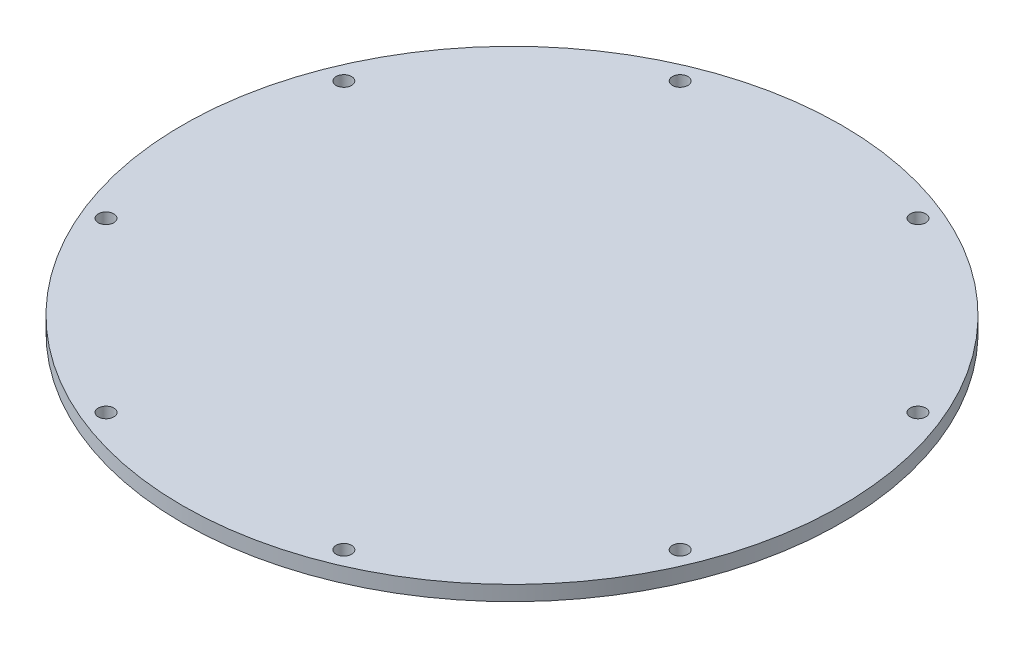
ISO-10303-21;
HEADER;
FILE_DESCRIPTION(('STEP AP214'),'2;1');
FILE_NAME('part.step','',(''),(''),'','','');
FILE_SCHEMA(('AUTOMOTIVE_DESIGN { 1 0 10303 214 1 1 1 1 }'));
ENDSEC;
DATA;
#1=APPLICATION_CONTEXT('core data for automotive mechanical design processes');
#2=APPLICATION_PROTOCOL_DEFINITION('international standard','automotive_design',2000,#1);
#3=PRODUCT_CONTEXT('',#1,'mechanical');
#4=PRODUCT('Part','Part','',(#3));
#5=PRODUCT_RELATED_PRODUCT_CATEGORY('part','',(#4));
#6=PRODUCT_DEFINITION_FORMATION('','',#4);
#7=PRODUCT_DEFINITION_CONTEXT('part definition',#1,'design');
#8=PRODUCT_DEFINITION('design','',#6,#7);
#9=PRODUCT_DEFINITION_SHAPE('','',#8);
#10=(LENGTH_UNIT() NAMED_UNIT(*) SI_UNIT(.MILLI.,.METRE.));
#11=(NAMED_UNIT(*) PLANE_ANGLE_UNIT() SI_UNIT($,.RADIAN.));
#12=(NAMED_UNIT(*) SI_UNIT($,.STERADIAN.) SOLID_ANGLE_UNIT());
#13=UNCERTAINTY_MEASURE_WITH_UNIT(LENGTH_MEASURE(1.E-05),#10,'distance_accuracy_value','');
#14=(GEOMETRIC_REPRESENTATION_CONTEXT(3) GLOBAL_UNCERTAINTY_ASSIGNED_CONTEXT((#13)) GLOBAL_UNIT_ASSIGNED_CONTEXT((#10,
#11,#12)) REPRESENTATION_CONTEXT('',''));
#15=CARTESIAN_POINT('',(0.,0.,0.));
#16=DIRECTION('',(0.,0.,1.));
#17=DIRECTION('',(1.,0.,0.));
#18=AXIS2_PLACEMENT_3D('',#15,#16,#17);
#19=CARTESIAN_POINT('',(0.,3.175,0.));
#20=DIRECTION('',(0.,-1.,0.));
#21=DIRECTION('',(0.,0.,-1.));
#22=AXIS2_PLACEMENT_3D('',#19,#20,#21);
#23=CYLINDRICAL_SURFACE('',#22,70.);
#24=CARTESIAN_POINT('',(0.,3.175,0.));
#25=DIRECTION('',(0.,1.,0.));
#26=DIRECTION('',(0.,0.,1.));
#27=AXIS2_PLACEMENT_3D('',#24,#25,#26);
#28=CIRCLE('',#27,70.);
#29=CARTESIAN_POINT('',(0.,3.175,70.));
#30=VERTEX_POINT('',#29);
#31=EDGE_CURVE('E10',#30,#30,#28,.T.);
#32=ORIENTED_EDGE('',*,*,#31,.F.);
#33=EDGE_LOOP('',(#32));
#34=FACE_BOUND('',#33,.T.);
#35=CARTESIAN_POINT('',(0.,0.,0.));
#36=DIRECTION('',(0.,1.,0.));
#37=DIRECTION('',(0.,0.,1.));
#38=AXIS2_PLACEMENT_3D('',#35,#36,#37);
#39=CIRCLE('',#38,70.);
#40=CARTESIAN_POINT('',(0.,0.,70.));
#41=VERTEX_POINT('',#40);
#42=EDGE_CURVE('E34',#41,#41,#39,.T.);
#43=ORIENTED_EDGE('',*,*,#42,.T.);
#44=EDGE_LOOP('',(#43));
#45=FACE_BOUND('',#44,.T.);
#46=ADVANCED_FACE('F31',(#34,#45),#23,.T.);
#47=CARTESIAN_POINT('',(0.,3.175,0.));
#48=DIRECTION('',(0.,1.,0.));
#49=DIRECTION('',(0.,0.,1.));
#50=AXIS2_PLACEMENT_3D('',#47,#48,#49);
#51=PLANE('',#50);
#52=CARTESIAN_POINT('',(60.9760491457449,3.175,-25.257106536096));
#53=DIRECTION('',(0.,1.,0.));
#54=DIRECTION('',(0.,0.,1.));
#55=AXIS2_PLACEMENT_3D('',#52,#53,#54);
#56=CIRCLE('',#55,1.65);
#57=CARTESIAN_POINT('',(60.9760491457449,3.175,-23.607106536096));
#58=VERTEX_POINT('',#57);
#59=EDGE_CURVE('E46',#58,#58,#56,.T.);
#60=ORIENTED_EDGE('',*,*,#59,.F.);
#61=EDGE_LOOP('',(#60));
#62=FACE_BOUND('',#61,.T.);
#63=CARTESIAN_POINT('',(60.9760491457449,3.175,25.257106536096));
#64=DIRECTION('',(0.,1.,0.));
#65=DIRECTION('',(0.,0.,-1.));
#66=AXIS2_PLACEMENT_3D('',#63,#64,#65);
#67=CIRCLE('',#66,1.65);
#68=CARTESIAN_POINT('',(60.9760491457449,3.175,23.607106536096));
#69=VERTEX_POINT('',#68);
#70=EDGE_CURVE('E65',#69,#69,#67,.T.);
#71=ORIENTED_EDGE('',*,*,#70,.F.);
#72=EDGE_LOOP('',(#71));
#73=FACE_BOUND('',#72,.T.);
#74=CARTESIAN_POINT('',(25.2571065360959,3.175,60.976049145745));
#75=DIRECTION('',(0.,1.,0.));
#76=DIRECTION('',(0.,0.,-1.));
#77=AXIS2_PLACEMENT_3D('',#74,#75,#76);
#78=CIRCLE('',#77,1.65);
#79=CARTESIAN_POINT('',(25.2571065360959,3.175,59.326049145745));
#80=VERTEX_POINT('',#79);
#81=EDGE_CURVE('E59',#80,#80,#78,.T.);
#82=ORIENTED_EDGE('',*,*,#81,.F.);
#83=EDGE_LOOP('',(#82));
#84=FACE_BOUND('',#83,.T.);
#85=CARTESIAN_POINT('',(-25.2571065360959,3.175,60.976049145745));
#86=DIRECTION('',(0.,1.,0.));
#87=DIRECTION('',(0.,0.,1.));
#88=AXIS2_PLACEMENT_3D('',#85,#86,#87);
#89=CIRCLE('',#88,1.65);
#90=CARTESIAN_POINT('',(-25.2571065360959,3.175,62.626049145745));
#91=VERTEX_POINT('',#90);
#92=EDGE_CURVE('E52',#91,#91,#89,.T.);
#93=ORIENTED_EDGE('',*,*,#92,.F.);
#94=EDGE_LOOP('',(#93));
#95=FACE_BOUND('',#94,.T.);
#96=CARTESIAN_POINT('',(-60.9760491457449,3.175,25.257106536096));
#97=DIRECTION('',(0.,1.,0.));
#98=DIRECTION('',(0.,0.,1.));
#99=AXIS2_PLACEMENT_3D('',#96,#97,#98);
#100=CIRCLE('',#99,1.65);
#101=CARTESIAN_POINT('',(-60.9760491457449,3.175,26.907106536096));
#102=VERTEX_POINT('',#101);
#103=EDGE_CURVE('E53',#102,#102,#100,.T.);
#104=ORIENTED_EDGE('',*,*,#103,.F.);
#105=EDGE_LOOP('',(#104));
#106=FACE_BOUND('',#105,.T.);
#107=CARTESIAN_POINT('',(-60.9760491457449,3.175,-25.257106536096));
#108=DIRECTION('',(0.,1.,0.));
#109=DIRECTION('',(0.,0.,-1.));
#110=AXIS2_PLACEMENT_3D('',#107,#108,#109);
#111=CIRCLE('',#110,1.65);
#112=CARTESIAN_POINT('',(-60.9760491457449,3.175,-26.907106536096));
#113=VERTEX_POINT('',#112);
#114=EDGE_CURVE('E82',#113,#113,#111,.T.);
#115=ORIENTED_EDGE('',*,*,#114,.F.);
#116=EDGE_LOOP('',(#115));
#117=FACE_BOUND('',#116,.T.);
#118=CARTESIAN_POINT('',(-25.2571065360959,3.175,-60.976049145745));
#119=DIRECTION('',(0.,1.,0.));
#120=DIRECTION('',(0.,0.,-1.));
#121=AXIS2_PLACEMENT_3D('',#118,#119,#120);
#122=CIRCLE('',#121,1.65);
#123=CARTESIAN_POINT('',(-25.2571065360959,3.175,-62.626049145745));
#124=VERTEX_POINT('',#123);
#125=EDGE_CURVE('E76',#124,#124,#122,.T.);
#126=ORIENTED_EDGE('',*,*,#125,.F.);
#127=EDGE_LOOP('',(#126));
#128=FACE_BOUND('',#127,.T.);
#129=CARTESIAN_POINT('',(25.2571065360959,3.175,-60.976049145745));
#130=DIRECTION('',(0.,1.,0.));
#131=DIRECTION('',(0.,0.,1.));
#132=AXIS2_PLACEMENT_3D('',#129,#130,#131);
#133=CIRCLE('',#132,1.65);
#134=CARTESIAN_POINT('',(25.2571065360959,3.175,-59.326049145745));
#135=VERTEX_POINT('',#134);
#136=EDGE_CURVE('E41',#135,#135,#133,.T.);
#137=ORIENTED_EDGE('',*,*,#136,.F.);
#138=EDGE_LOOP('',(#137));
#139=FACE_BOUND('',#138,.T.);
#140=ORIENTED_EDGE('',*,*,#31,.T.);
#141=EDGE_LOOP('',(#140));
#142=FACE_BOUND('',#141,.T.);
#143=ADVANCED_FACE('F94',(#62,#73,#84,#95,#106,#117,#128,#139,#142),#51,.T.);
#144=CARTESIAN_POINT('',(0.,0.,0.));
#145=DIRECTION('',(0.,1.,0.));
#146=DIRECTION('',(0.,0.,1.));
#147=AXIS2_PLACEMENT_3D('',#144,#145,#146);
#148=PLANE('',#147);
#149=CARTESIAN_POINT('',(60.9760491457449,0.,-25.257106536096));
#150=DIRECTION('',(0.,1.,0.));
#151=DIRECTION('',(0.,0.,1.));
#152=AXIS2_PLACEMENT_3D('',#149,#150,#151);
#153=CIRCLE('',#152,1.65);
#154=CARTESIAN_POINT('',(60.9760491457449,0.,-23.607106536096));
#155=VERTEX_POINT('',#154);
#156=EDGE_CURVE('E68',#155,#155,#153,.T.);
#157=ORIENTED_EDGE('',*,*,#156,.T.);
#158=EDGE_LOOP('',(#157));
#159=FACE_BOUND('',#158,.T.);
#160=CARTESIAN_POINT('',(60.9760491457449,0.,25.257106536096));
#161=DIRECTION('',(0.,1.,0.));
#162=DIRECTION('',(0.,0.,-1.));
#163=AXIS2_PLACEMENT_3D('',#160,#161,#162);
#164=CIRCLE('',#163,1.65);
#165=CARTESIAN_POINT('',(60.9760491457449,0.,23.607106536096));
#166=VERTEX_POINT('',#165);
#167=EDGE_CURVE('E62',#166,#166,#164,.T.);
#168=ORIENTED_EDGE('',*,*,#167,.T.);
#169=EDGE_LOOP('',(#168));
#170=FACE_BOUND('',#169,.T.);
#171=CARTESIAN_POINT('',(25.2571065360959,0.,60.976049145745));
#172=DIRECTION('',(0.,1.,0.));
#173=DIRECTION('',(0.,0.,-1.));
#174=AXIS2_PLACEMENT_3D('',#171,#172,#173);
#175=CIRCLE('',#174,1.65);
#176=CARTESIAN_POINT('',(25.2571065360959,0.,59.326049145745));
#177=VERTEX_POINT('',#176);
#178=EDGE_CURVE('E56',#177,#177,#175,.T.);
#179=ORIENTED_EDGE('',*,*,#178,.T.);
#180=EDGE_LOOP('',(#179));
#181=FACE_BOUND('',#180,.T.);
#182=CARTESIAN_POINT('',(-25.2571065360959,0.,60.976049145745));
#183=DIRECTION('',(0.,1.,0.));
#184=DIRECTION('',(0.,0.,1.));
#185=AXIS2_PLACEMENT_3D('',#182,#183,#184);
#186=CIRCLE('',#185,1.65);
#187=CARTESIAN_POINT('',(-25.2571065360959,0.,62.626049145745));
#188=VERTEX_POINT('',#187);
#189=EDGE_CURVE('E49',#188,#188,#186,.T.);
#190=ORIENTED_EDGE('',*,*,#189,.T.);
#191=EDGE_LOOP('',(#190));
#192=FACE_BOUND('',#191,.T.);
#193=CARTESIAN_POINT('',(-60.9760491457449,0.,25.257106536096));
#194=DIRECTION('',(0.,1.,0.));
#195=DIRECTION('',(0.,0.,1.));
#196=AXIS2_PLACEMENT_3D('',#193,#194,#195);
#197=CIRCLE('',#196,1.65);
#198=CARTESIAN_POINT('',(-60.9760491457449,0.,26.907106536096));
#199=VERTEX_POINT('',#198);
#200=EDGE_CURVE('E85',#199,#199,#197,.T.);
#201=ORIENTED_EDGE('',*,*,#200,.T.);
#202=EDGE_LOOP('',(#201));
#203=FACE_BOUND('',#202,.T.);
#204=CARTESIAN_POINT('',(-60.9760491457449,0.,-25.257106536096));
#205=DIRECTION('',(0.,1.,0.));
#206=DIRECTION('',(0.,0.,-1.));
#207=AXIS2_PLACEMENT_3D('',#204,#205,#206);
#208=CIRCLE('',#207,1.65);
#209=CARTESIAN_POINT('',(-60.9760491457449,0.,-26.907106536096));
#210=VERTEX_POINT('',#209);
#211=EDGE_CURVE('E79',#210,#210,#208,.T.);
#212=ORIENTED_EDGE('',*,*,#211,.T.);
#213=EDGE_LOOP('',(#212));
#214=FACE_BOUND('',#213,.T.);
#215=CARTESIAN_POINT('',(-25.2571065360959,0.,-60.976049145745));
#216=DIRECTION('',(0.,1.,0.));
#217=DIRECTION('',(0.,0.,-1.));
#218=AXIS2_PLACEMENT_3D('',#215,#216,#217);
#219=CIRCLE('',#218,1.65);
#220=CARTESIAN_POINT('',(-25.2571065360959,0.,-62.626049145745));
#221=VERTEX_POINT('',#220);
#222=EDGE_CURVE('E73',#221,#221,#219,.T.);
#223=ORIENTED_EDGE('',*,*,#222,.T.);
#224=EDGE_LOOP('',(#223));
#225=FACE_BOUND('',#224,.T.);
#226=CARTESIAN_POINT('',(25.2571065360959,0.,-60.976049145745));
#227=DIRECTION('',(0.,1.,0.));
#228=DIRECTION('',(0.,0.,1.));
#229=AXIS2_PLACEMENT_3D('',#226,#227,#228);
#230=CIRCLE('',#229,1.65);
#231=CARTESIAN_POINT('',(25.2571065360959,0.,-59.326049145745));
#232=VERTEX_POINT('',#231);
#233=EDGE_CURVE('E43',#232,#232,#230,.T.);
#234=ORIENTED_EDGE('',*,*,#233,.T.);
#235=EDGE_LOOP('',(#234));
#236=FACE_BOUND('',#235,.T.);
#237=ORIENTED_EDGE('',*,*,#42,.F.);
#238=EDGE_LOOP('',(#237));
#239=FACE_BOUND('',#238,.T.);
#240=ADVANCED_FACE('F97',(#159,#170,#181,#192,#203,#214,#225,#236,#239),#148,.F.);
#241=CARTESIAN_POINT('',(25.2571065360959,3.175,-60.976049145745));
#242=DIRECTION('',(0.,-1.,0.));
#243=DIRECTION('',(0.,0.,-1.));
#244=AXIS2_PLACEMENT_3D('',#241,#242,#243);
#245=CYLINDRICAL_SURFACE('',#244,1.65);
#246=ORIENTED_EDGE('',*,*,#136,.T.);
#247=EDGE_LOOP('',(#246));
#248=FACE_BOUND('',#247,.T.);
#249=ORIENTED_EDGE('',*,*,#233,.F.);
#250=EDGE_LOOP('',(#249));
#251=FACE_BOUND('',#250,.T.);
#252=ADVANCED_FACE('F106',(#248,#251),#245,.F.);
#253=CARTESIAN_POINT('',(-25.2571065360959,3.175,-60.976049145745));
#254=DIRECTION('',(0.,-1.,0.));
#255=DIRECTION('',(0.,0.,-1.));
#256=AXIS2_PLACEMENT_3D('',#253,#254,#255);
#257=CYLINDRICAL_SURFACE('',#256,1.65);
#258=ORIENTED_EDGE('',*,*,#125,.T.);
#259=EDGE_LOOP('',(#258));
#260=FACE_BOUND('',#259,.T.);
#261=ORIENTED_EDGE('',*,*,#222,.F.);
#262=EDGE_LOOP('',(#261));
#263=FACE_BOUND('',#262,.T.);
#264=ADVANCED_FACE('F109',(#260,#263),#257,.F.);
#265=CARTESIAN_POINT('',(-60.9760491457449,3.175,-25.257106536096));
#266=DIRECTION('',(0.,-1.,0.));
#267=DIRECTION('',(0.,0.,-1.));
#268=AXIS2_PLACEMENT_3D('',#265,#266,#267);
#269=CYLINDRICAL_SURFACE('',#268,1.65);
#270=ORIENTED_EDGE('',*,*,#114,.T.);
#271=EDGE_LOOP('',(#270));
#272=FACE_BOUND('',#271,.T.);
#273=ORIENTED_EDGE('',*,*,#211,.F.);
#274=EDGE_LOOP('',(#273));
#275=FACE_BOUND('',#274,.T.);
#276=ADVANCED_FACE('F140',(#272,#275),#269,.F.);
#277=CARTESIAN_POINT('',(-60.9760491457449,3.175,25.257106536096));
#278=DIRECTION('',(0.,-1.,0.));
#279=DIRECTION('',(0.,0.,-1.));
#280=AXIS2_PLACEMENT_3D('',#277,#278,#279);
#281=CYLINDRICAL_SURFACE('',#280,1.65);
#282=ORIENTED_EDGE('',*,*,#103,.T.);
#283=EDGE_LOOP('',(#282));
#284=FACE_BOUND('',#283,.T.);
#285=ORIENTED_EDGE('',*,*,#200,.F.);
#286=EDGE_LOOP('',(#285));
#287=FACE_BOUND('',#286,.T.);
#288=ADVANCED_FACE('F91',(#284,#287),#281,.F.);
#289=CARTESIAN_POINT('',(-25.2571065360959,3.175,60.976049145745));
#290=DIRECTION('',(0.,-1.,0.));
#291=DIRECTION('',(0.,0.,-1.));
#292=AXIS2_PLACEMENT_3D('',#289,#290,#291);
#293=CYLINDRICAL_SURFACE('',#292,1.65);
#294=ORIENTED_EDGE('',*,*,#92,.T.);
#295=EDGE_LOOP('',(#294));
#296=FACE_BOUND('',#295,.T.);
#297=ORIENTED_EDGE('',*,*,#189,.F.);
#298=EDGE_LOOP('',(#297));
#299=FACE_BOUND('',#298,.T.);
#300=ADVANCED_FACE('F155',(#296,#299),#293,.F.);
#301=CARTESIAN_POINT('',(25.2571065360959,3.175,60.976049145745));
#302=DIRECTION('',(0.,-1.,0.));
#303=DIRECTION('',(0.,0.,-1.));
#304=AXIS2_PLACEMENT_3D('',#301,#302,#303);
#305=CYLINDRICAL_SURFACE('',#304,1.65);
#306=ORIENTED_EDGE('',*,*,#81,.T.);
#307=EDGE_LOOP('',(#306));
#308=FACE_BOUND('',#307,.T.);
#309=ORIENTED_EDGE('',*,*,#178,.F.);
#310=EDGE_LOOP('',(#309));
#311=FACE_BOUND('',#310,.T.);
#312=ADVANCED_FACE('F162',(#308,#311),#305,.F.);
#313=CARTESIAN_POINT('',(60.9760491457449,3.175,25.257106536096));
#314=DIRECTION('',(0.,-1.,0.));
#315=DIRECTION('',(0.,0.,-1.));
#316=AXIS2_PLACEMENT_3D('',#313,#314,#315);
#317=CYLINDRICAL_SURFACE('',#316,1.65);
#318=ORIENTED_EDGE('',*,*,#70,.T.);
#319=EDGE_LOOP('',(#318));
#320=FACE_BOUND('',#319,.T.);
#321=ORIENTED_EDGE('',*,*,#167,.F.);
#322=EDGE_LOOP('',(#321));
#323=FACE_BOUND('',#322,.T.);
#324=ADVANCED_FACE('F170',(#320,#323),#317,.F.);
#325=CARTESIAN_POINT('',(60.9760491457449,3.175,-25.257106536096));
#326=DIRECTION('',(0.,-1.,0.));
#327=DIRECTION('',(0.,0.,-1.));
#328=AXIS2_PLACEMENT_3D('',#325,#326,#327);
#329=CYLINDRICAL_SURFACE('',#328,1.65);
#330=ORIENTED_EDGE('',*,*,#59,.T.);
#331=EDGE_LOOP('',(#330));
#332=FACE_BOUND('',#331,.T.);
#333=ORIENTED_EDGE('',*,*,#156,.F.);
#334=EDGE_LOOP('',(#333));
#335=FACE_BOUND('',#334,.T.);
#336=ADVANCED_FACE('F178',(#332,#335),#329,.F.);
#337=CLOSED_SHELL('',(#46,#143,#240,#252,#264,#276,#288,#300,#312,#324,#336));
#338=MANIFOLD_SOLID_BREP('B2',#337);
#339=ADVANCED_BREP_SHAPE_REPRESENTATION('',(#18,#338),#14);
#340=SHAPE_DEFINITION_REPRESENTATION(#9,#339);
ENDSEC;
END-ISO-10303-21;
